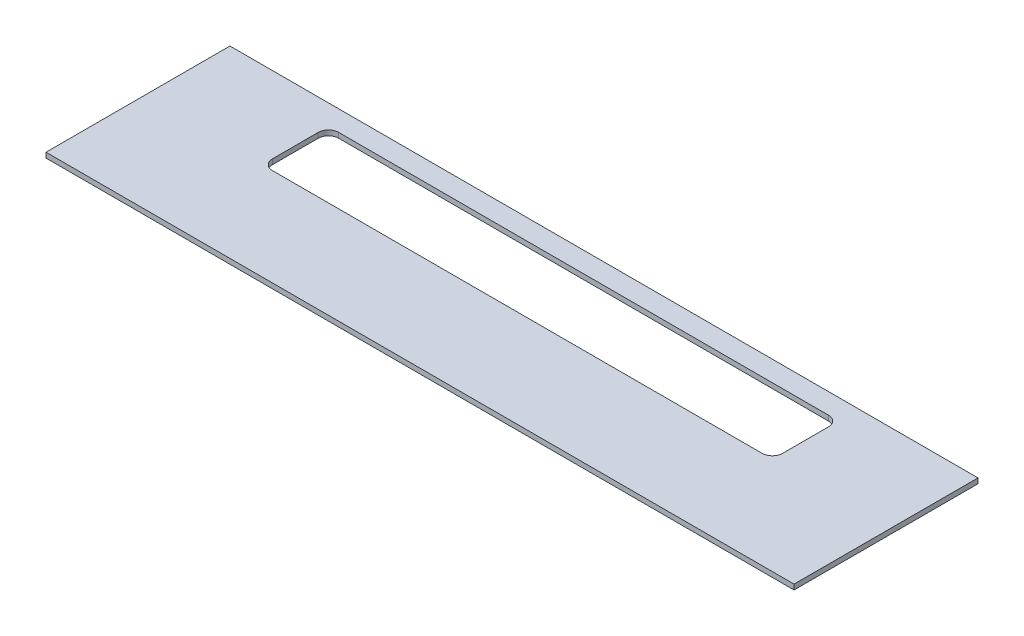
ISO-10303-21;
HEADER;
FILE_DESCRIPTION(('STEP AP214'),'2;1');
FILE_NAME('part.step','',(''),(''),'','','');
FILE_SCHEMA(('AUTOMOTIVE_DESIGN { 1 0 10303 214 1 1 1 1 }'));
ENDSEC;
DATA;
#1=APPLICATION_CONTEXT('core data for automotive mechanical design processes');
#2=APPLICATION_PROTOCOL_DEFINITION('international standard','automotive_design',2000,#1);
#3=PRODUCT_CONTEXT('',#1,'mechanical');
#4=PRODUCT('Part','Part','',(#3));
#5=PRODUCT_RELATED_PRODUCT_CATEGORY('part','',(#4));
#6=PRODUCT_DEFINITION_FORMATION('','',#4);
#7=PRODUCT_DEFINITION_CONTEXT('part definition',#1,'design');
#8=PRODUCT_DEFINITION('design','',#6,#7);
#9=PRODUCT_DEFINITION_SHAPE('','',#8);
#10=(LENGTH_UNIT() NAMED_UNIT(*) SI_UNIT(.MILLI.,.METRE.));
#11=(NAMED_UNIT(*) PLANE_ANGLE_UNIT() SI_UNIT($,.RADIAN.));
#12=(NAMED_UNIT(*) SI_UNIT($,.STERADIAN.) SOLID_ANGLE_UNIT());
#13=UNCERTAINTY_MEASURE_WITH_UNIT(LENGTH_MEASURE(1.E-05),#10,'distance_accuracy_value','');
#14=(GEOMETRIC_REPRESENTATION_CONTEXT(3) GLOBAL_UNCERTAINTY_ASSIGNED_CONTEXT((#13)) GLOBAL_UNIT_ASSIGNED_CONTEXT((#10,
#11,#12)) REPRESENTATION_CONTEXT('',''));
#15=CARTESIAN_POINT('',(0.,0.,0.));
#16=DIRECTION('',(0.,0.,1.));
#17=DIRECTION('',(1.,0.,0.));
#18=AXIS2_PLACEMENT_3D('',#15,#16,#17);
#19=CARTESIAN_POINT('',(-116.205,1.5875,28.575));
#20=DIRECTION('',(1.,0.,0.));
#21=DIRECTION('',(0.,0.,-1.));
#22=AXIS2_PLACEMENT_3D('',#19,#20,#21);
#23=PLANE('',#22);
#24=DIRECTION('',(0.,0.,1.));
#25=VECTOR('',#24,1.);
#26=CARTESIAN_POINT('',(-116.205,0.,28.575));
#27=LINE('',#26,#25);
#28=CARTESIAN_POINT('',(-116.205,0.,-28.575));
#29=VERTEX_POINT('',#28);
#30=CARTESIAN_POINT('',(-116.205,0.,28.575));
#31=VERTEX_POINT('',#30);
#32=EDGE_CURVE('E146',#29,#31,#27,.T.);
#33=ORIENTED_EDGE('',*,*,#32,.T.);
#34=DIRECTION('',(0.,-1.,0.));
#35=VECTOR('',#34,1.);
#36=CARTESIAN_POINT('',(-116.205,1.5875,28.575));
#37=LINE('',#36,#35);
#38=CARTESIAN_POINT('',(-116.205,1.5875,28.575));
#39=VERTEX_POINT('',#38);
#40=EDGE_CURVE('E127',#39,#31,#37,.T.);
#41=ORIENTED_EDGE('',*,*,#40,.F.);
#42=DIRECTION('',(0.,0.,1.));
#43=VECTOR('',#42,1.);
#44=CARTESIAN_POINT('',(-116.205,1.5875,28.575));
#45=LINE('',#44,#43);
#46=CARTESIAN_POINT('',(-116.205,1.5875,-28.575));
#47=VERTEX_POINT('',#46);
#48=EDGE_CURVE('E134',#47,#39,#45,.T.);
#49=ORIENTED_EDGE('',*,*,#48,.F.);
#50=DIRECTION('',(0.,-1.,0.));
#51=VECTOR('',#50,1.);
#52=CARTESIAN_POINT('',(-116.205,1.5875,-28.575));
#53=LINE('',#52,#51);
#54=EDGE_CURVE('E220',#47,#29,#53,.T.);
#55=ORIENTED_EDGE('',*,*,#54,.T.);
#56=EDGE_LOOP('',(#33,#41,#49,#55));
#57=FACE_BOUND('',#56,.T.);
#58=ADVANCED_FACE('F33',(#57),#23,.F.);
#59=CARTESIAN_POINT('',(116.205,1.5875,28.575));
#60=DIRECTION('',(0.,0.,-1.));
#61=DIRECTION('',(-1.,0.,0.));
#62=AXIS2_PLACEMENT_3D('',#59,#60,#61);
#63=PLANE('',#62);
#64=DIRECTION('',(1.,0.,0.));
#65=VECTOR('',#64,1.);
#66=CARTESIAN_POINT('',(116.205,0.,28.575));
#67=LINE('',#66,#65);
#68=CARTESIAN_POINT('',(116.205,0.,28.575));
#69=VERTEX_POINT('',#68);
#70=EDGE_CURVE('E222',#31,#69,#67,.T.);
#71=ORIENTED_EDGE('',*,*,#70,.T.);
#72=DIRECTION('',(0.,-1.,0.));
#73=VECTOR('',#72,1.);
#74=CARTESIAN_POINT('',(116.205,1.5875,28.575));
#75=LINE('',#74,#73);
#76=CARTESIAN_POINT('',(116.205,1.5875,28.575));
#77=VERTEX_POINT('',#76);
#78=EDGE_CURVE('E130',#77,#69,#75,.T.);
#79=ORIENTED_EDGE('',*,*,#78,.F.);
#80=DIRECTION('',(1.,0.,0.));
#81=VECTOR('',#80,1.);
#82=CARTESIAN_POINT('',(116.205,1.5875,28.575));
#83=LINE('',#82,#81);
#84=EDGE_CURVE('E123',#39,#77,#83,.T.);
#85=ORIENTED_EDGE('',*,*,#84,.F.);
#86=ORIENTED_EDGE('',*,*,#40,.T.);
#87=EDGE_LOOP('',(#71,#79,#85,#86));
#88=FACE_BOUND('',#87,.T.);
#89=ADVANCED_FACE('F125',(#88),#63,.F.);
#90=CARTESIAN_POINT('',(116.205,1.5875,28.575));
#91=DIRECTION('',(-1.,0.,0.));
#92=DIRECTION('',(0.,0.,1.));
#93=AXIS2_PLACEMENT_3D('',#90,#91,#92);
#94=PLANE('',#93);
#95=DIRECTION('',(0.,0.,-1.));
#96=VECTOR('',#95,1.);
#97=CARTESIAN_POINT('',(116.205,0.,28.575));
#98=LINE('',#97,#96);
#99=CARTESIAN_POINT('',(116.205,0.,-28.575));
#100=VERTEX_POINT('',#99);
#101=EDGE_CURVE('E224',#69,#100,#98,.T.);
#102=ORIENTED_EDGE('',*,*,#101,.T.);
#103=DIRECTION('',(0.,-1.,0.));
#104=VECTOR('',#103,1.);
#105=CARTESIAN_POINT('',(116.205,1.5875,-28.575));
#106=LINE('',#105,#104);
#107=CARTESIAN_POINT('',(116.205,1.5875,-28.575));
#108=VERTEX_POINT('',#107);
#109=EDGE_CURVE('E151',#108,#100,#106,.T.);
#110=ORIENTED_EDGE('',*,*,#109,.F.);
#111=DIRECTION('',(0.,0.,-1.));
#112=VECTOR('',#111,1.);
#113=CARTESIAN_POINT('',(116.205,1.5875,28.575));
#114=LINE('',#113,#112);
#115=EDGE_CURVE('E133',#77,#108,#114,.T.);
#116=ORIENTED_EDGE('',*,*,#115,.F.);
#117=ORIENTED_EDGE('',*,*,#78,.T.);
#118=EDGE_LOOP('',(#102,#110,#116,#117));
#119=FACE_BOUND('',#118,.T.);
#120=ADVANCED_FACE('F234',(#119),#94,.F.);
#121=CARTESIAN_POINT('',(116.205,1.5875,-28.575));
#122=DIRECTION('',(0.,0.,1.));
#123=DIRECTION('',(1.,0.,0.));
#124=AXIS2_PLACEMENT_3D('',#121,#122,#123);
#125=PLANE('',#124);
#126=DIRECTION('',(-1.,0.,0.));
#127=VECTOR('',#126,1.);
#128=CARTESIAN_POINT('',(116.205,0.,-28.575));
#129=LINE('',#128,#127);
#130=EDGE_CURVE('E143',#100,#29,#129,.T.);
#131=ORIENTED_EDGE('',*,*,#130,.T.);
#132=ORIENTED_EDGE('',*,*,#54,.F.);
#133=DIRECTION('',(-1.,0.,0.));
#134=VECTOR('',#133,1.);
#135=CARTESIAN_POINT('',(116.205,1.5875,-28.575));
#136=LINE('',#135,#134);
#137=EDGE_CURVE('E139',#108,#47,#136,.T.);
#138=ORIENTED_EDGE('',*,*,#137,.F.);
#139=ORIENTED_EDGE('',*,*,#109,.T.);
#140=EDGE_LOOP('',(#131,#132,#138,#139));
#141=FACE_BOUND('',#140,.T.);
#142=ADVANCED_FACE('F231',(#141),#125,.F.);
#143=CARTESIAN_POINT('',(0.,1.5875,0.));
#144=DIRECTION('',(0.,1.,0.));
#145=DIRECTION('',(0.,0.,1.));
#146=AXIS2_PLACEMENT_3D('',#143,#144,#145);
#147=PLANE('',#146);
#148=DIRECTION('',(0.,0.,1.));
#149=VECTOR('',#148,1.);
#150=CARTESIAN_POINT('',(-79.248,1.5875,-22.225));
#151=LINE('',#150,#149);
#152=CARTESIAN_POINT('',(-79.248,1.5875,-19.05));
#153=VERTEX_POINT('',#152);
#154=CARTESIAN_POINT('',(-79.248,1.5875,-4.82600000000001));
#155=VERTEX_POINT('',#154);
#156=EDGE_CURVE('E186',#153,#155,#151,.T.);
#157=ORIENTED_EDGE('',*,*,#156,.F.);
#158=CARTESIAN_POINT('',(-76.073,1.5875,-19.05));
#159=DIRECTION('',(0.,1.,0.));
#160=DIRECTION('',(0.,0.,1.));
#161=AXIS2_PLACEMENT_3D('',#158,#159,#160);
#162=CIRCLE('',#161,3.175);
#163=CARTESIAN_POINT('',(-76.073,1.5875,-22.225));
#164=VERTEX_POINT('',#163);
#165=EDGE_CURVE('E41',#153,#164,#162,.F.);
#166=ORIENTED_EDGE('',*,*,#165,.T.);
#167=DIRECTION('',(-1.,0.,0.));
#168=VECTOR('',#167,1.);
#169=CARTESIAN_POINT('',(-79.248,1.5875,-22.225));
#170=LINE('',#169,#168);
#171=CARTESIAN_POINT('',(76.073,1.5875,-22.225));
#172=VERTEX_POINT('',#171);
#173=EDGE_CURVE('E184',#172,#164,#170,.T.);
#174=ORIENTED_EDGE('',*,*,#173,.F.);
#175=CARTESIAN_POINT('',(76.073,1.5875,-19.05));
#176=DIRECTION('',(0.,1.,0.));
#177=DIRECTION('',(0.,0.,1.));
#178=AXIS2_PLACEMENT_3D('',#175,#176,#177);
#179=CIRCLE('',#178,3.175);
#180=CARTESIAN_POINT('',(79.248,1.5875,-19.05));
#181=VERTEX_POINT('',#180);
#182=EDGE_CURVE('E179',#172,#181,#179,.F.);
#183=ORIENTED_EDGE('',*,*,#182,.T.);
#184=DIRECTION('',(0.,0.,-1.));
#185=VECTOR('',#184,1.);
#186=CARTESIAN_POINT('',(79.248,1.5875,-22.225));
#187=LINE('',#186,#185);
#188=CARTESIAN_POINT('',(79.248,1.5875,-4.82600000000004));
#189=VERTEX_POINT('',#188);
#190=EDGE_CURVE('E192',#189,#181,#187,.T.);
#191=ORIENTED_EDGE('',*,*,#190,.F.);
#192=CARTESIAN_POINT('',(76.073,1.5875,-4.82600000000004));
#193=DIRECTION('',(0.,1.,0.));
#194=DIRECTION('',(0.,0.,1.));
#195=AXIS2_PLACEMENT_3D('',#192,#193,#194);
#196=CIRCLE('',#195,3.175);
#197=CARTESIAN_POINT('',(76.073,1.5875,-1.65100000000003));
#198=VERTEX_POINT('',#197);
#199=EDGE_CURVE('E175',#189,#198,#196,.F.);
#200=ORIENTED_EDGE('',*,*,#199,.T.);
#201=DIRECTION('',(1.,0.,0.));
#202=VECTOR('',#201,1.);
#203=CARTESIAN_POINT('',(-79.248,1.5875,-1.65100000000001));
#204=LINE('',#203,#202);
#205=CARTESIAN_POINT('',(-76.073,1.5875,-1.65100000000001));
#206=VERTEX_POINT('',#205);
#207=EDGE_CURVE('E213',#206,#198,#204,.T.);
#208=ORIENTED_EDGE('',*,*,#207,.F.);
#209=CARTESIAN_POINT('',(-76.073,1.5875,-4.82600000000001));
#210=DIRECTION('',(0.,1.,0.));
#211=DIRECTION('',(0.,0.,1.));
#212=AXIS2_PLACEMENT_3D('',#209,#210,#211);
#213=CIRCLE('',#212,3.175);
#214=EDGE_CURVE('E171',#206,#155,#213,.F.);
#215=ORIENTED_EDGE('',*,*,#214,.T.);
#216=EDGE_LOOP('',(#157,#166,#174,#183,#191,#200,#208,#215));
#217=FACE_BOUND('',#216,.T.);
#218=ORIENTED_EDGE('',*,*,#48,.T.);
#219=ORIENTED_EDGE('',*,*,#84,.T.);
#220=ORIENTED_EDGE('',*,*,#115,.T.);
#221=ORIENTED_EDGE('',*,*,#137,.T.);
#222=EDGE_LOOP('',(#218,#219,#220,#221));
#223=FACE_BOUND('',#222,.T.);
#224=ADVANCED_FACE('F137',(#217,#223),#147,.T.);
#225=CARTESIAN_POINT('',(0.,0.,0.));
#226=DIRECTION('',(0.,1.,0.));
#227=DIRECTION('',(0.,0.,1.));
#228=AXIS2_PLACEMENT_3D('',#225,#226,#227);
#229=PLANE('',#228);
#230=DIRECTION('',(0.,0.,-1.));
#231=VECTOR('',#230,1.);
#232=CARTESIAN_POINT('',(79.248,0.,-22.225));
#233=LINE('',#232,#231);
#234=CARTESIAN_POINT('',(79.248,0.,-4.82600000000004));
#235=VERTEX_POINT('',#234);
#236=CARTESIAN_POINT('',(79.248,0.,-19.05));
#237=VERTEX_POINT('',#236);
#238=EDGE_CURVE('E207',#235,#237,#233,.T.);
#239=ORIENTED_EDGE('',*,*,#238,.T.);
#240=CARTESIAN_POINT('',(76.073,0.,-19.05));
#241=DIRECTION('',(0.,1.,0.));
#242=DIRECTION('',(0.,0.,1.));
#243=AXIS2_PLACEMENT_3D('',#240,#241,#242);
#244=CIRCLE('',#243,3.175);
#245=CARTESIAN_POINT('',(76.073,0.,-22.225));
#246=VERTEX_POINT('',#245);
#247=EDGE_CURVE('E55',#237,#246,#244,.T.);
#248=ORIENTED_EDGE('',*,*,#247,.T.);
#249=DIRECTION('',(-1.,0.,0.));
#250=VECTOR('',#249,1.);
#251=CARTESIAN_POINT('',(-79.248,0.,-22.225));
#252=LINE('',#251,#250);
#253=CARTESIAN_POINT('',(-76.073,0.,-22.225));
#254=VERTEX_POINT('',#253);
#255=EDGE_CURVE('E200',#246,#254,#252,.T.);
#256=ORIENTED_EDGE('',*,*,#255,.T.);
#257=CARTESIAN_POINT('',(-76.073,0.,-19.05));
#258=DIRECTION('',(0.,1.,0.));
#259=DIRECTION('',(0.,0.,1.));
#260=AXIS2_PLACEMENT_3D('',#257,#258,#259);
#261=CIRCLE('',#260,3.175);
#262=CARTESIAN_POINT('',(-79.248,0.,-19.05));
#263=VERTEX_POINT('',#262);
#264=EDGE_CURVE('E11',#254,#263,#261,.T.);
#265=ORIENTED_EDGE('',*,*,#264,.T.);
#266=DIRECTION('',(0.,0.,1.));
#267=VECTOR('',#266,1.);
#268=CARTESIAN_POINT('',(-79.248,0.,-22.225));
#269=LINE('',#268,#267);
#270=CARTESIAN_POINT('',(-79.248,0.,-4.82600000000001));
#271=VERTEX_POINT('',#270);
#272=EDGE_CURVE('E191',#263,#271,#269,.T.);
#273=ORIENTED_EDGE('',*,*,#272,.T.);
#274=CARTESIAN_POINT('',(-76.073,0.,-4.82600000000001));
#275=DIRECTION('',(0.,1.,0.));
#276=DIRECTION('',(0.,0.,1.));
#277=AXIS2_PLACEMENT_3D('',#274,#275,#276);
#278=CIRCLE('',#277,3.175);
#279=CARTESIAN_POINT('',(-76.073,0.,-1.65100000000001));
#280=VERTEX_POINT('',#279);
#281=EDGE_CURVE('E173',#271,#280,#278,.T.);
#282=ORIENTED_EDGE('',*,*,#281,.T.);
#283=DIRECTION('',(1.,0.,0.));
#284=VECTOR('',#283,1.);
#285=CARTESIAN_POINT('',(-79.248,0.,-1.65100000000001));
#286=LINE('',#285,#284);
#287=CARTESIAN_POINT('',(76.073,0.,-1.65100000000003));
#288=VERTEX_POINT('',#287);
#289=EDGE_CURVE('E204',#280,#288,#286,.T.);
#290=ORIENTED_EDGE('',*,*,#289,.T.);
#291=CARTESIAN_POINT('',(76.073,0.,-4.82600000000004));
#292=DIRECTION('',(0.,1.,0.));
#293=DIRECTION('',(0.,0.,1.));
#294=AXIS2_PLACEMENT_3D('',#291,#292,#293);
#295=CIRCLE('',#294,3.175);
#296=EDGE_CURVE('E177',#288,#235,#295,.T.);
#297=ORIENTED_EDGE('',*,*,#296,.T.);
#298=EDGE_LOOP('',(#239,#248,#256,#265,#273,#282,#290,#297));
#299=FACE_BOUND('',#298,.T.);
#300=ORIENTED_EDGE('',*,*,#32,.F.);
#301=ORIENTED_EDGE('',*,*,#130,.F.);
#302=ORIENTED_EDGE('',*,*,#101,.F.);
#303=ORIENTED_EDGE('',*,*,#70,.F.);
#304=EDGE_LOOP('',(#300,#301,#302,#303));
#305=FACE_BOUND('',#304,.T.);
#306=ADVANCED_FACE('F197',(#299,#305),#229,.F.);
#307=CARTESIAN_POINT('',(-79.248,0.,-22.225));
#308=DIRECTION('',(-1.,0.,0.));
#309=DIRECTION('',(0.,0.,1.));
#310=AXIS2_PLACEMENT_3D('',#307,#308,#309);
#311=PLANE('',#310);
#312=ORIENTED_EDGE('',*,*,#156,.T.);
#313=DIRECTION('',(0.,1.,0.));
#314=VECTOR('',#313,1.);
#315=CARTESIAN_POINT('',(-79.248,0.,-4.82600000000001));
#316=LINE('',#315,#314);
#317=EDGE_CURVE('E160',#155,#271,#316,.F.);
#318=ORIENTED_EDGE('',*,*,#317,.T.);
#319=ORIENTED_EDGE('',*,*,#272,.F.);
#320=DIRECTION('',(0.,1.,0.));
#321=VECTOR('',#320,1.);
#322=CARTESIAN_POINT('',(-79.248,1.5875,-19.05));
#323=LINE('',#322,#321);
#324=EDGE_CURVE('E157',#263,#153,#323,.T.);
#325=ORIENTED_EDGE('',*,*,#324,.T.);
#326=EDGE_LOOP('',(#312,#318,#319,#325));
#327=FACE_BOUND('',#326,.T.);
#328=ADVANCED_FACE('F202',(#327),#311,.F.);
#329=CARTESIAN_POINT('',(-79.248,0.,-22.225));
#330=DIRECTION('',(0.,0.,-1.));
#331=DIRECTION('',(-1.,0.,0.));
#332=AXIS2_PLACEMENT_3D('',#329,#330,#331);
#333=PLANE('',#332);
#334=ORIENTED_EDGE('',*,*,#255,.F.);
#335=DIRECTION('',(0.,1.,0.));
#336=VECTOR('',#335,1.);
#337=CARTESIAN_POINT('',(76.073,1.5875,-22.225));
#338=LINE('',#337,#336);
#339=EDGE_CURVE('E168',#246,#172,#338,.T.);
#340=ORIENTED_EDGE('',*,*,#339,.T.);
#341=ORIENTED_EDGE('',*,*,#173,.T.);
#342=DIRECTION('',(0.,1.,0.));
#343=VECTOR('',#342,1.);
#344=CARTESIAN_POINT('',(-76.073,0.,-22.225));
#345=LINE('',#344,#343);
#346=EDGE_CURVE('E48',#164,#254,#345,.F.);
#347=ORIENTED_EDGE('',*,*,#346,.T.);
#348=EDGE_LOOP('',(#334,#340,#341,#347));
#349=FACE_BOUND('',#348,.T.);
#350=ADVANCED_FACE('F189',(#349),#333,.F.);
#351=CARTESIAN_POINT('',(79.248,0.,-22.225));
#352=DIRECTION('',(1.,0.,0.));
#353=DIRECTION('',(0.,0.,-1.));
#354=AXIS2_PLACEMENT_3D('',#351,#352,#353);
#355=PLANE('',#354);
#356=ORIENTED_EDGE('',*,*,#238,.F.);
#357=DIRECTION('',(0.,1.,0.));
#358=VECTOR('',#357,1.);
#359=CARTESIAN_POINT('',(79.248,1.5875,-4.82600000000004));
#360=LINE('',#359,#358);
#361=EDGE_CURVE('E164',#235,#189,#360,.T.);
#362=ORIENTED_EDGE('',*,*,#361,.T.);
#363=ORIENTED_EDGE('',*,*,#190,.T.);
#364=DIRECTION('',(0.,1.,0.));
#365=VECTOR('',#364,1.);
#366=CARTESIAN_POINT('',(79.248,0.,-19.05));
#367=LINE('',#366,#365);
#368=EDGE_CURVE('E162',#181,#237,#367,.F.);
#369=ORIENTED_EDGE('',*,*,#368,.T.);
#370=EDGE_LOOP('',(#356,#362,#363,#369));
#371=FACE_BOUND('',#370,.T.);
#372=ADVANCED_FACE('F266',(#371),#355,.F.);
#373=CARTESIAN_POINT('',(-79.248,0.,-1.65100000000001));
#374=DIRECTION('',(0.,0.,1.));
#375=DIRECTION('',(1.,0.,0.));
#376=AXIS2_PLACEMENT_3D('',#373,#374,#375);
#377=PLANE('',#376);
#378=ORIENTED_EDGE('',*,*,#289,.F.);
#379=DIRECTION('',(0.,1.,0.));
#380=VECTOR('',#379,1.);
#381=CARTESIAN_POINT('',(-76.073,1.5875,-1.65100000000001));
#382=LINE('',#381,#380);
#383=EDGE_CURVE('E149',#280,#206,#382,.T.);
#384=ORIENTED_EDGE('',*,*,#383,.T.);
#385=ORIENTED_EDGE('',*,*,#207,.T.);
#386=DIRECTION('',(0.,1.,0.));
#387=VECTOR('',#386,1.);
#388=CARTESIAN_POINT('',(76.073,0.,-1.65100000000003));
#389=LINE('',#388,#387);
#390=EDGE_CURVE('E147',#198,#288,#389,.F.);
#391=ORIENTED_EDGE('',*,*,#390,.T.);
#392=EDGE_LOOP('',(#378,#384,#385,#391));
#393=FACE_BOUND('',#392,.T.);
#394=ADVANCED_FACE('F252',(#393),#377,.F.);
#395=CARTESIAN_POINT('',(-76.073,0.,-4.82600000000001));
#396=DIRECTION('',(0.,-1.,0.));
#397=DIRECTION('',(0.,0.,-1.));
#398=AXIS2_PLACEMENT_3D('',#395,#396,#397);
#399=CYLINDRICAL_SURFACE('',#398,3.175);
#400=ORIENTED_EDGE('',*,*,#281,.F.);
#401=ORIENTED_EDGE('',*,*,#317,.F.);
#402=ORIENTED_EDGE('',*,*,#214,.F.);
#403=ORIENTED_EDGE('',*,*,#383,.F.);
#404=EDGE_LOOP('',(#400,#401,#402,#403));
#405=FACE_BOUND('',#404,.T.);
#406=ADVANCED_FACE('F248',(#405),#399,.F.);
#407=CARTESIAN_POINT('',(76.073,0.,-4.82600000000004));
#408=DIRECTION('',(0.,-1.,0.));
#409=DIRECTION('',(0.,0.,-1.));
#410=AXIS2_PLACEMENT_3D('',#407,#408,#409);
#411=CYLINDRICAL_SURFACE('',#410,3.175);
#412=ORIENTED_EDGE('',*,*,#296,.F.);
#413=ORIENTED_EDGE('',*,*,#390,.F.);
#414=ORIENTED_EDGE('',*,*,#199,.F.);
#415=ORIENTED_EDGE('',*,*,#361,.F.);
#416=EDGE_LOOP('',(#412,#413,#414,#415));
#417=FACE_BOUND('',#416,.T.);
#418=ADVANCED_FACE('F251',(#417),#411,.F.);
#419=CARTESIAN_POINT('',(76.073,0.,-19.05));
#420=DIRECTION('',(0.,-1.,0.));
#421=DIRECTION('',(0.,0.,-1.));
#422=AXIS2_PLACEMENT_3D('',#419,#420,#421);
#423=CYLINDRICAL_SURFACE('',#422,3.175);
#424=ORIENTED_EDGE('',*,*,#247,.F.);
#425=ORIENTED_EDGE('',*,*,#368,.F.);
#426=ORIENTED_EDGE('',*,*,#182,.F.);
#427=ORIENTED_EDGE('',*,*,#339,.F.);
#428=EDGE_LOOP('',(#424,#425,#426,#427));
#429=FACE_BOUND('',#428,.T.);
#430=ADVANCED_FACE('F255',(#429),#423,.F.);
#431=CARTESIAN_POINT('',(-76.073,0.,-19.05));
#432=DIRECTION('',(0.,-1.,0.));
#433=DIRECTION('',(0.,0.,-1.));
#434=AXIS2_PLACEMENT_3D('',#431,#432,#433);
#435=CYLINDRICAL_SURFACE('',#434,3.175);
#436=ORIENTED_EDGE('',*,*,#264,.F.);
#437=ORIENTED_EDGE('',*,*,#346,.F.);
#438=ORIENTED_EDGE('',*,*,#165,.F.);
#439=ORIENTED_EDGE('',*,*,#324,.F.);
#440=EDGE_LOOP('',(#436,#437,#438,#439));
#441=FACE_BOUND('',#440,.T.);
#442=ADVANCED_FACE('F35',(#441),#435,.F.);
#443=CLOSED_SHELL('',(#58,#89,#120,#142,#224,#306,#328,#350,#372,#394,#406,#418,#430,#442));
#444=MANIFOLD_SOLID_BREP('B2',#443);
#445=ADVANCED_BREP_SHAPE_REPRESENTATION('',(#18,#444),#14);
#446=SHAPE_DEFINITION_REPRESENTATION(#9,#445);
ENDSEC;
END-ISO-10303-21;
